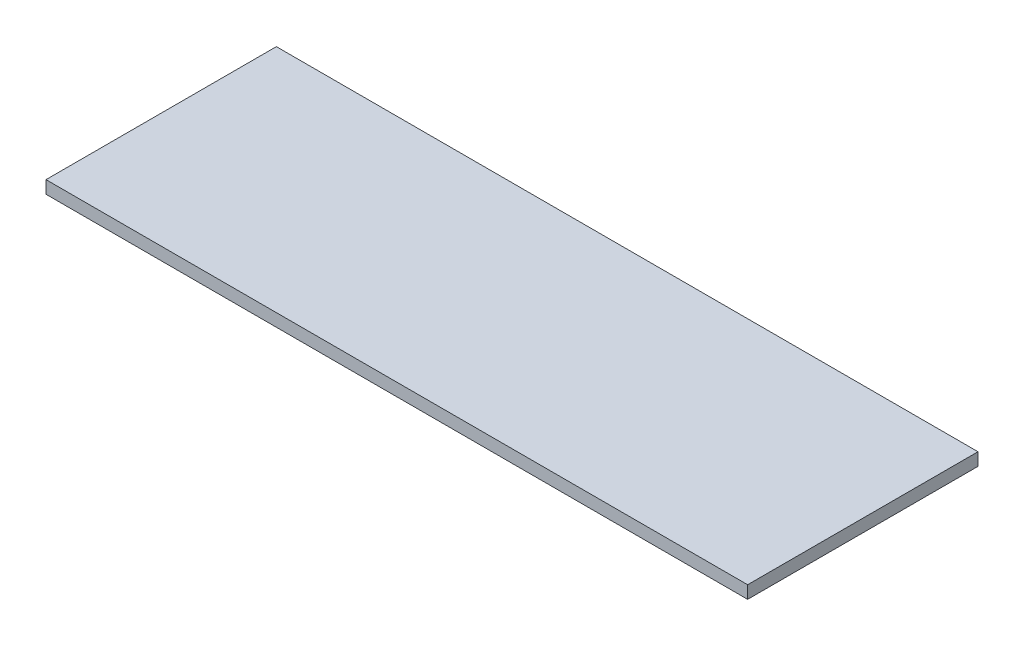
ISO-10303-21;
HEADER;
FILE_DESCRIPTION(('STEP AP214'),'2;1');
FILE_NAME('part.step','',(''),(''),'','','');
FILE_SCHEMA(('AUTOMOTIVE_DESIGN { 1 0 10303 214 1 1 1 1 }'));
ENDSEC;
DATA;
#1=APPLICATION_CONTEXT('core data for automotive mechanical design processes');
#2=APPLICATION_PROTOCOL_DEFINITION('international standard','automotive_design',2000,#1);
#3=PRODUCT_CONTEXT('',#1,'mechanical');
#4=PRODUCT('Part','Part','',(#3));
#5=PRODUCT_RELATED_PRODUCT_CATEGORY('part','',(#4));
#6=PRODUCT_DEFINITION_FORMATION('','',#4);
#7=PRODUCT_DEFINITION_CONTEXT('part definition',#1,'design');
#8=PRODUCT_DEFINITION('design','',#6,#7);
#9=PRODUCT_DEFINITION_SHAPE('','',#8);
#10=(LENGTH_UNIT() NAMED_UNIT(*) SI_UNIT(.MILLI.,.METRE.));
#11=(NAMED_UNIT(*) PLANE_ANGLE_UNIT() SI_UNIT($,.RADIAN.));
#12=(NAMED_UNIT(*) SI_UNIT($,.STERADIAN.) SOLID_ANGLE_UNIT());
#13=UNCERTAINTY_MEASURE_WITH_UNIT(LENGTH_MEASURE(1.E-05),#10,'distance_accuracy_value','');
#14=(GEOMETRIC_REPRESENTATION_CONTEXT(3) GLOBAL_UNCERTAINTY_ASSIGNED_CONTEXT((#13)) GLOBAL_UNIT_ASSIGNED_CONTEXT((#10,
#11,#12)) REPRESENTATION_CONTEXT('',''));
#15=CARTESIAN_POINT('',(0.,0.,0.));
#16=DIRECTION('',(0.,0.,1.));
#17=DIRECTION('',(1.,0.,0.));
#18=AXIS2_PLACEMENT_3D('',#15,#16,#17);
#19=CARTESIAN_POINT('',(-527.05,-107.95,173.0375));
#20=DIRECTION('',(1.,0.,0.));
#21=DIRECTION('',(0.,0.,-1.));
#22=AXIS2_PLACEMENT_3D('',#19,#20,#21);
#23=PLANE('',#22);
#24=DIRECTION('',(0.,0.,-1.));
#25=VECTOR('',#24,1.);
#26=CARTESIAN_POINT('',(-527.05,-88.9,173.0375));
#27=LINE('',#26,#25);
#28=CARTESIAN_POINT('',(-527.05,-88.9,173.0375));
#29=VERTEX_POINT('',#28);
#30=CARTESIAN_POINT('',(-527.05,-88.9,-173.0375));
#31=VERTEX_POINT('',#30);
#32=EDGE_CURVE('E109',#29,#31,#27,.T.);
#33=ORIENTED_EDGE('',*,*,#32,.T.);
#34=DIRECTION('',(0.,1.,0.));
#35=VECTOR('',#34,1.);
#36=CARTESIAN_POINT('',(-527.05,-107.95,-173.0375));
#37=LINE('',#36,#35);
#38=CARTESIAN_POINT('',(-527.05,-107.95,-173.0375));
#39=VERTEX_POINT('',#38);
#40=EDGE_CURVE('E11',#39,#31,#37,.T.);
#41=ORIENTED_EDGE('',*,*,#40,.F.);
#42=DIRECTION('',(0.,0.,-1.));
#43=VECTOR('',#42,1.);
#44=CARTESIAN_POINT('',(-527.05,-107.95,173.0375));
#45=LINE('',#44,#43);
#46=CARTESIAN_POINT('',(-527.05,-107.95,173.0375));
#47=VERTEX_POINT('',#46);
#48=EDGE_CURVE('E92',#47,#39,#45,.T.);
#49=ORIENTED_EDGE('',*,*,#48,.F.);
#50=DIRECTION('',(0.,1.,0.));
#51=VECTOR('',#50,1.);
#52=CARTESIAN_POINT('',(-527.05,-107.95,173.0375));
#53=LINE('',#52,#51);
#54=EDGE_CURVE('E105',#47,#29,#53,.T.);
#55=ORIENTED_EDGE('',*,*,#54,.T.);
#56=EDGE_LOOP('',(#33,#41,#49,#55));
#57=FACE_BOUND('',#56,.T.);
#58=ADVANCED_FACE('F40',(#57),#23,.F.);
#59=CARTESIAN_POINT('',(-527.05,-107.95,-173.0375));
#60=DIRECTION('',(0.,0.,1.));
#61=DIRECTION('',(1.,0.,0.));
#62=AXIS2_PLACEMENT_3D('',#59,#60,#61);
#63=PLANE('',#62);
#64=DIRECTION('',(1.,0.,0.));
#65=VECTOR('',#64,1.);
#66=CARTESIAN_POINT('',(-527.05,-88.9,-173.0375));
#67=LINE('',#66,#65);
#68=CARTESIAN_POINT('',(527.05,-88.9,-173.0375));
#69=VERTEX_POINT('',#68);
#70=EDGE_CURVE('E97',#31,#69,#67,.T.);
#71=ORIENTED_EDGE('',*,*,#70,.T.);
#72=DIRECTION('',(0.,1.,0.));
#73=VECTOR('',#72,1.);
#74=CARTESIAN_POINT('',(527.05,-107.95,-173.0375));
#75=LINE('',#74,#73);
#76=CARTESIAN_POINT('',(527.05,-107.95,-173.0375));
#77=VERTEX_POINT('',#76);
#78=EDGE_CURVE('E49',#77,#69,#75,.T.);
#79=ORIENTED_EDGE('',*,*,#78,.F.);
#80=DIRECTION('',(1.,0.,0.));
#81=VECTOR('',#80,1.);
#82=CARTESIAN_POINT('',(-527.05,-107.95,-173.0375));
#83=LINE('',#82,#81);
#84=EDGE_CURVE('E87',#39,#77,#83,.T.);
#85=ORIENTED_EDGE('',*,*,#84,.F.);
#86=ORIENTED_EDGE('',*,*,#40,.T.);
#87=EDGE_LOOP('',(#71,#79,#85,#86));
#88=FACE_BOUND('',#87,.T.);
#89=ADVANCED_FACE('F96',(#88),#63,.F.);
#90=CARTESIAN_POINT('',(527.05,-107.95,173.0375));
#91=DIRECTION('',(-1.,0.,0.));
#92=DIRECTION('',(0.,0.,1.));
#93=AXIS2_PLACEMENT_3D('',#90,#91,#92);
#94=PLANE('',#93);
#95=DIRECTION('',(0.,0.,1.));
#96=VECTOR('',#95,1.);
#97=CARTESIAN_POINT('',(527.05,-88.9,173.0375));
#98=LINE('',#97,#96);
#99=CARTESIAN_POINT('',(527.05,-88.9,173.0375));
#100=VERTEX_POINT('',#99);
#101=EDGE_CURVE('E74',#69,#100,#98,.T.);
#102=ORIENTED_EDGE('',*,*,#101,.T.);
#103=DIRECTION('',(0.,1.,0.));
#104=VECTOR('',#103,1.);
#105=CARTESIAN_POINT('',(527.05,-107.95,173.0375));
#106=LINE('',#105,#104);
#107=CARTESIAN_POINT('',(527.05,-107.95,173.0375));
#108=VERTEX_POINT('',#107);
#109=EDGE_CURVE('E99',#108,#100,#106,.T.);
#110=ORIENTED_EDGE('',*,*,#109,.F.);
#111=DIRECTION('',(0.,0.,1.));
#112=VECTOR('',#111,1.);
#113=CARTESIAN_POINT('',(527.05,-107.95,173.0375));
#114=LINE('',#113,#112);
#115=EDGE_CURVE('E90',#77,#108,#114,.T.);
#116=ORIENTED_EDGE('',*,*,#115,.F.);
#117=ORIENTED_EDGE('',*,*,#78,.T.);
#118=EDGE_LOOP('',(#102,#110,#116,#117));
#119=FACE_BOUND('',#118,.T.);
#120=ADVANCED_FACE('F100',(#119),#94,.F.);
#121=CARTESIAN_POINT('',(-527.05,-107.95,173.0375));
#122=DIRECTION('',(0.,0.,-1.));
#123=DIRECTION('',(-1.,0.,0.));
#124=AXIS2_PLACEMENT_3D('',#121,#122,#123);
#125=PLANE('',#124);
#126=DIRECTION('',(-1.,0.,0.));
#127=VECTOR('',#126,1.);
#128=CARTESIAN_POINT('',(-527.05,-88.9,173.0375));
#129=LINE('',#128,#127);
#130=EDGE_CURVE('E80',#100,#29,#129,.T.);
#131=ORIENTED_EDGE('',*,*,#130,.T.);
#132=ORIENTED_EDGE('',*,*,#54,.F.);
#133=DIRECTION('',(-1.,0.,0.));
#134=VECTOR('',#133,1.);
#135=CARTESIAN_POINT('',(-527.05,-107.95,173.0375));
#136=LINE('',#135,#134);
#137=EDGE_CURVE('E57',#108,#47,#136,.T.);
#138=ORIENTED_EDGE('',*,*,#137,.F.);
#139=ORIENTED_EDGE('',*,*,#109,.T.);
#140=EDGE_LOOP('',(#131,#132,#138,#139));
#141=FACE_BOUND('',#140,.T.);
#142=ADVANCED_FACE('F123',(#141),#125,.F.);
#143=CARTESIAN_POINT('',(0.,-107.95,0.));
#144=DIRECTION('',(0.,-1.,0.));
#145=DIRECTION('',(0.,0.,-1.));
#146=AXIS2_PLACEMENT_3D('',#143,#144,#145);
#147=PLANE('',#146);
#148=ORIENTED_EDGE('',*,*,#48,.T.);
#149=ORIENTED_EDGE('',*,*,#84,.T.);
#150=ORIENTED_EDGE('',*,*,#115,.T.);
#151=ORIENTED_EDGE('',*,*,#137,.T.);
#152=EDGE_LOOP('',(#148,#149,#150,#151));
#153=FACE_BOUND('',#152,.T.);
#154=ADVANCED_FACE('F88',(#153),#147,.T.);
#155=CARTESIAN_POINT('',(0.,-88.9,0.));
#156=DIRECTION('',(0.,-1.,0.));
#157=DIRECTION('',(0.,0.,-1.));
#158=AXIS2_PLACEMENT_3D('',#155,#156,#157);
#159=PLANE('',#158);
#160=ORIENTED_EDGE('',*,*,#32,.F.);
#161=ORIENTED_EDGE('',*,*,#130,.F.);
#162=ORIENTED_EDGE('',*,*,#101,.F.);
#163=ORIENTED_EDGE('',*,*,#70,.F.);
#164=EDGE_LOOP('',(#160,#161,#162,#163));
#165=FACE_BOUND('',#164,.T.);
#166=ADVANCED_FACE('F126',(#165),#159,.F.);
#167=CLOSED_SHELL('',(#58,#89,#120,#142,#154,#166));
#168=MANIFOLD_SOLID_BREP('B2',#167);
#169=ADVANCED_BREP_SHAPE_REPRESENTATION('',(#18,#168),#14);
#170=SHAPE_DEFINITION_REPRESENTATION(#9,#169);
ENDSEC;
END-ISO-10303-21;
